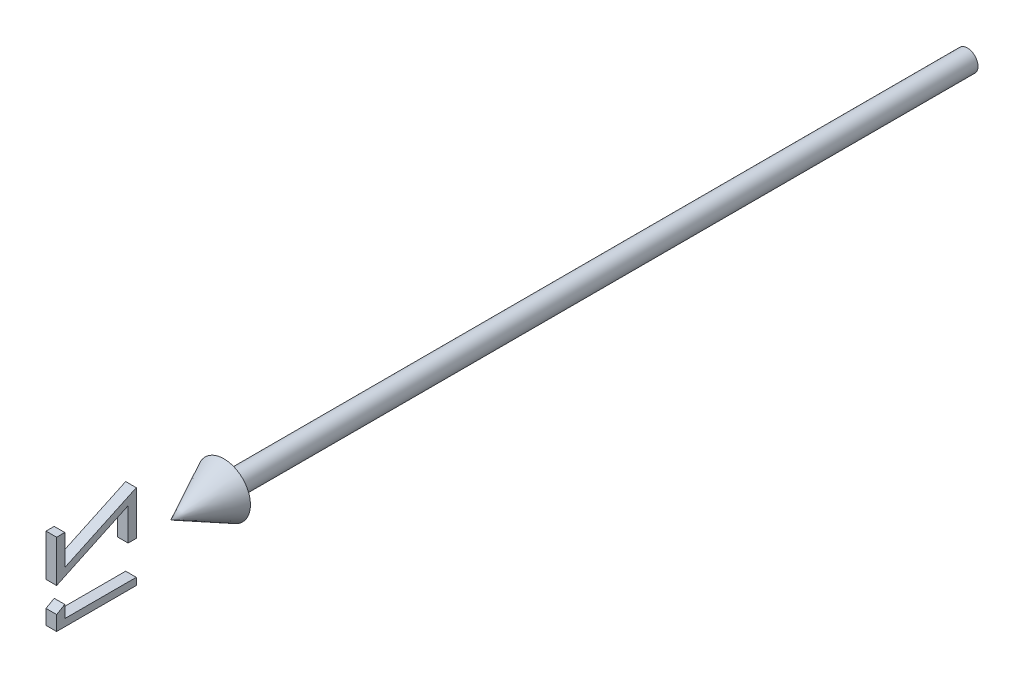
ISO-10303-21;
HEADER;
FILE_DESCRIPTION(('STEP AP214'),'2;1');
FILE_NAME('part.step','',(''),(''),'','','');
FILE_SCHEMA(('AUTOMOTIVE_DESIGN { 1 0 10303 214 1 1 1 1 }'));
ENDSEC;
DATA;
#1=APPLICATION_CONTEXT('core data for automotive mechanical design processes');
#2=APPLICATION_PROTOCOL_DEFINITION('international standard','automotive_design',2000,#1);
#3=PRODUCT_CONTEXT('',#1,'mechanical');
#4=PRODUCT('Part','Part','',(#3));
#5=PRODUCT_RELATED_PRODUCT_CATEGORY('part','',(#4));
#6=PRODUCT_DEFINITION_FORMATION('','',#4);
#7=PRODUCT_DEFINITION_CONTEXT('part definition',#1,'design');
#8=PRODUCT_DEFINITION('design','',#6,#7);
#9=PRODUCT_DEFINITION_SHAPE('','',#8);
#10=(LENGTH_UNIT() NAMED_UNIT(*) SI_UNIT(.MILLI.,.METRE.));
#11=(NAMED_UNIT(*) PLANE_ANGLE_UNIT() SI_UNIT($,.RADIAN.));
#12=(NAMED_UNIT(*) SI_UNIT($,.STERADIAN.) SOLID_ANGLE_UNIT());
#13=UNCERTAINTY_MEASURE_WITH_UNIT(LENGTH_MEASURE(1.E-05),#10,'distance_accuracy_value','');
#14=(GEOMETRIC_REPRESENTATION_CONTEXT(3) GLOBAL_UNCERTAINTY_ASSIGNED_CONTEXT((#13)) GLOBAL_UNIT_ASSIGNED_CONTEXT((#10,
#11,#12)) REPRESENTATION_CONTEXT('',''));
#15=CARTESIAN_POINT('',(0.,0.,0.));
#16=DIRECTION('',(0.,0.,1.));
#17=DIRECTION('',(1.,0.,0.));
#18=AXIS2_PLACEMENT_3D('',#15,#16,#17);
#19=CARTESIAN_POINT('',(1.00000000000009,-2.77218270945082,170.961538461538));
#20=DIRECTION('',(0.,-0.867930013859705,-0.49668651183769));
#21=DIRECTION('',(0.,0.49668651183769,-0.867930013859705));
#22=AXIS2_PLACEMENT_3D('',#19,#20,#21);
#23=PLANE('',#22);
#24=DIRECTION('',(-1.,0.,0.));
#25=VECTOR('',#24,1.);
#26=CARTESIAN_POINT('',(1.00000000000009,-2.77218270945082,170.961538461538));
#27=LINE('',#26,#25);
#28=CARTESIAN_POINT('',(1.00000000000009,-2.77218270945082,170.961538461538));
#29=VERTEX_POINT('',#28);
#30=CARTESIAN_POINT('',(-0.999999999999906,-2.77218270945082,170.961538461538));
#31=VERTEX_POINT('',#30);
#32=EDGE_CURVE('E116',#29,#31,#27,.T.);
#33=ORIENTED_EDGE('',*,*,#32,.T.);
#34=DIRECTION('',(0.,-0.49668651183769,0.867930013859705));
#35=VECTOR('',#34,1.);
#36=CARTESIAN_POINT('',(-0.999999999999906,-2.77218270945082,170.961538461538));
#37=LINE('',#36,#35);
#38=CARTESIAN_POINT('',(-0.999999999999895,-3.65259136329697,172.5));
#39=VERTEX_POINT('',#38);
#40=EDGE_CURVE('E110',#31,#39,#37,.T.);
#41=ORIENTED_EDGE('',*,*,#40,.T.);
#42=DIRECTION('',(-1.,0.,0.));
#43=VECTOR('',#42,1.);
#44=CARTESIAN_POINT('',(1.0000000000001,-3.65259136329697,172.5));
#45=LINE('',#44,#43);
#46=CARTESIAN_POINT('',(1.0000000000001,-3.65259136329697,172.5));
#47=VERTEX_POINT('',#46);
#48=EDGE_CURVE('E12',#47,#39,#45,.T.);
#49=ORIENTED_EDGE('',*,*,#48,.F.);
#50=DIRECTION('',(0.,-0.49668651183769,0.867930013859705));
#51=VECTOR('',#50,1.);
#52=CARTESIAN_POINT('',(1.00000000000009,-2.77218270945082,170.961538461538));
#53=LINE('',#52,#51);
#54=EDGE_CURVE('E128',#29,#47,#53,.T.);
#55=ORIENTED_EDGE('',*,*,#54,.F.);
#56=EDGE_LOOP('',(#33,#41,#49,#55));
#57=FACE_BOUND('',#56,.T.);
#58=ADVANCED_FACE('F46',(#57),#23,.F.);
#59=CARTESIAN_POINT('',(1.0000000000001,-3.65259136329697,172.5));
#60=DIRECTION('',(0.,0.,-1.));
#61=DIRECTION('',(-1.,0.,0.));
#62=AXIS2_PLACEMENT_3D('',#59,#60,#61);
#63=PLANE('',#62);
#64=ORIENTED_EDGE('',*,*,#48,.T.);
#65=DIRECTION('',(0.,-1.,0.));
#66=VECTOR('',#65,1.);
#67=CARTESIAN_POINT('',(-0.999999999999895,-3.65259136329697,172.5));
#68=LINE('',#67,#66);
#69=CARTESIAN_POINT('',(-0.999999999999895,-6.42602886329697,172.5));
#70=VERTEX_POINT('',#69);
#71=EDGE_CURVE('E100',#39,#70,#68,.T.);
#72=ORIENTED_EDGE('',*,*,#71,.T.);
#73=DIRECTION('',(-1.,0.,0.));
#74=VECTOR('',#73,1.);
#75=CARTESIAN_POINT('',(1.0000000000001,-6.42602886329697,172.5));
#76=LINE('',#75,#74);
#77=CARTESIAN_POINT('',(1.0000000000001,-6.42602886329697,172.5));
#78=VERTEX_POINT('',#77);
#79=EDGE_CURVE('E53',#78,#70,#76,.T.);
#80=ORIENTED_EDGE('',*,*,#79,.F.);
#81=DIRECTION('',(0.,-1.,0.));
#82=VECTOR('',#81,1.);
#83=CARTESIAN_POINT('',(1.0000000000001,-3.65259136329697,172.5));
#84=LINE('',#83,#82);
#85=EDGE_CURVE('E101',#47,#78,#84,.T.);
#86=ORIENTED_EDGE('',*,*,#85,.F.);
#87=EDGE_LOOP('',(#64,#72,#80,#86));
#88=FACE_BOUND('',#87,.T.);
#89=ADVANCED_FACE('F98',(#88),#63,.F.);
#90=CARTESIAN_POINT('',(1.0000000000001,-6.42602886329697,172.5));
#91=DIRECTION('',(0.,1.,0.));
#92=DIRECTION('',(0.,0.,1.));
#93=AXIS2_PLACEMENT_3D('',#90,#91,#92);
#94=PLANE('',#93);
#95=ORIENTED_EDGE('',*,*,#79,.T.);
#96=DIRECTION('',(0.,0.,-1.));
#97=VECTOR('',#96,1.);
#98=CARTESIAN_POINT('',(-0.999999999999895,-6.42602886329697,172.5));
#99=LINE('',#98,#97);
#100=CARTESIAN_POINT('',(-1.,-6.42602886329697,157.5));
#101=VERTEX_POINT('',#100);
#102=EDGE_CURVE('E114',#70,#101,#99,.T.);
#103=ORIENTED_EDGE('',*,*,#102,.T.);
#104=DIRECTION('',(-1.,0.,0.));
#105=VECTOR('',#104,1.);
#106=CARTESIAN_POINT('',(1.,-6.42602886329697,157.5));
#107=LINE('',#106,#105);
#108=CARTESIAN_POINT('',(1.,-6.42602886329697,157.5));
#109=VERTEX_POINT('',#108);
#110=EDGE_CURVE('E142',#109,#101,#107,.T.);
#111=ORIENTED_EDGE('',*,*,#110,.F.);
#112=DIRECTION('',(0.,0.,-1.));
#113=VECTOR('',#112,1.);
#114=CARTESIAN_POINT('',(1.0000000000001,-6.42602886329697,172.5));
#115=LINE('',#114,#113);
#116=EDGE_CURVE('E131',#78,#109,#115,.T.);
#117=ORIENTED_EDGE('',*,*,#116,.F.);
#118=EDGE_LOOP('',(#95,#103,#111,#117));
#119=FACE_BOUND('',#118,.T.);
#120=ADVANCED_FACE('F145',(#119),#94,.F.);
#121=CARTESIAN_POINT('',(1.,-6.42602886329697,157.5));
#122=DIRECTION('',(0.,0.,1.));
#123=DIRECTION('',(1.,0.,0.));
#124=AXIS2_PLACEMENT_3D('',#121,#122,#123);
#125=PLANE('',#124);
#126=ORIENTED_EDGE('',*,*,#110,.T.);
#127=DIRECTION('',(0.,1.,0.));
#128=VECTOR('',#127,1.);
#129=CARTESIAN_POINT('',(-1.,-6.42602886329697,157.5));
#130=LINE('',#129,#128);
#131=CARTESIAN_POINT('',(-1.,-5.07987501714312,157.5));
#132=VERTEX_POINT('',#131);
#133=EDGE_CURVE('E120',#101,#132,#130,.T.);
#134=ORIENTED_EDGE('',*,*,#133,.T.);
#135=DIRECTION('',(-1.,0.,0.));
#136=VECTOR('',#135,1.);
#137=CARTESIAN_POINT('',(1.,-5.07987501714312,157.5));
#138=LINE('',#137,#136);
#139=CARTESIAN_POINT('',(1.,-5.07987501714312,157.5));
#140=VERTEX_POINT('',#139);
#141=EDGE_CURVE('E140',#140,#132,#138,.T.);
#142=ORIENTED_EDGE('',*,*,#141,.F.);
#143=DIRECTION('',(0.,1.,0.));
#144=VECTOR('',#143,1.);
#145=CARTESIAN_POINT('',(1.,-6.42602886329697,157.5));
#146=LINE('',#145,#144);
#147=EDGE_CURVE('E133',#109,#140,#146,.T.);
#148=ORIENTED_EDGE('',*,*,#147,.F.);
#149=EDGE_LOOP('',(#126,#134,#142,#148));
#150=FACE_BOUND('',#149,.T.);
#151=ADVANCED_FACE('F151',(#150),#125,.F.);
#152=CARTESIAN_POINT('',(1.,-5.07987501714312,157.5));
#153=DIRECTION('',(0.,-1.,0.));
#154=DIRECTION('',(0.,0.,-1.));
#155=AXIS2_PLACEMENT_3D('',#152,#153,#154);
#156=PLANE('',#155);
#157=ORIENTED_EDGE('',*,*,#141,.T.);
#158=DIRECTION('',(0.,0.,1.));
#159=VECTOR('',#158,1.);
#160=CARTESIAN_POINT('',(-1.,-5.07987501714312,157.5));
#161=LINE('',#160,#159);
#162=CARTESIAN_POINT('',(-0.999999999999906,-5.07987501714312,170.961538461538));
#163=VERTEX_POINT('',#162);
#164=EDGE_CURVE('E123',#132,#163,#161,.T.);
#165=ORIENTED_EDGE('',*,*,#164,.T.);
#166=DIRECTION('',(-1.,0.,0.));
#167=VECTOR('',#166,1.);
#168=CARTESIAN_POINT('',(1.00000000000009,-5.07987501714312,170.961538461538));
#169=LINE('',#168,#167);
#170=CARTESIAN_POINT('',(1.00000000000009,-5.07987501714312,170.961538461538));
#171=VERTEX_POINT('',#170);
#172=EDGE_CURVE('E138',#171,#163,#169,.T.);
#173=ORIENTED_EDGE('',*,*,#172,.F.);
#174=DIRECTION('',(0.,0.,1.));
#175=VECTOR('',#174,1.);
#176=CARTESIAN_POINT('',(1.,-5.07987501714312,157.5));
#177=LINE('',#176,#175);
#178=EDGE_CURVE('E65',#140,#171,#177,.T.);
#179=ORIENTED_EDGE('',*,*,#178,.F.);
#180=EDGE_LOOP('',(#157,#165,#173,#179));
#181=FACE_BOUND('',#180,.T.);
#182=ADVANCED_FACE('F154',(#181),#156,.F.);
#183=CARTESIAN_POINT('',(1.00000000000009,-5.07987501714312,170.961538461538));
#184=DIRECTION('',(0.,0.,1.));
#185=DIRECTION('',(1.,0.,0.));
#186=AXIS2_PLACEMENT_3D('',#183,#184,#185);
#187=PLANE('',#186);
#188=ORIENTED_EDGE('',*,*,#172,.T.);
#189=DIRECTION('',(0.,1.,0.));
#190=VECTOR('',#189,1.);
#191=CARTESIAN_POINT('',(-0.999999999999906,-5.07987501714312,170.961538461538));
#192=LINE('',#191,#190);
#193=EDGE_CURVE('E126',#163,#31,#192,.T.);
#194=ORIENTED_EDGE('',*,*,#193,.T.);
#195=ORIENTED_EDGE('',*,*,#32,.F.);
#196=DIRECTION('',(0.,1.,0.));
#197=VECTOR('',#196,1.);
#198=CARTESIAN_POINT('',(1.00000000000009,-5.07987501714312,170.961538461538));
#199=LINE('',#198,#197);
#200=EDGE_CURVE('E60',#171,#29,#199,.T.);
#201=ORIENTED_EDGE('',*,*,#200,.F.);
#202=EDGE_LOOP('',(#188,#194,#195,#201));
#203=FACE_BOUND('',#202,.T.);
#204=ADVANCED_FACE('F156',(#203),#187,.F.);
#205=CARTESIAN_POINT('',(0.9999999999989,0.,0.));
#206=DIRECTION('',(1.,0.,0.));
#207=DIRECTION('',(0.,0.,-1.));
#208=AXIS2_PLACEMENT_3D('',#205,#206,#207);
#209=PLANE('',#208);
#210=ORIENTED_EDGE('',*,*,#54,.T.);
#211=ORIENTED_EDGE('',*,*,#85,.T.);
#212=ORIENTED_EDGE('',*,*,#116,.T.);
#213=ORIENTED_EDGE('',*,*,#147,.T.);
#214=ORIENTED_EDGE('',*,*,#178,.T.);
#215=ORIENTED_EDGE('',*,*,#200,.T.);
#216=EDGE_LOOP('',(#210,#211,#212,#213,#214,#215));
#217=FACE_BOUND('',#216,.T.);
#218=ADVANCED_FACE('F148',(#217),#209,.T.);
#219=CARTESIAN_POINT('',(-1.0000000000011,0.,0.));
#220=DIRECTION('',(1.,0.,0.));
#221=DIRECTION('',(0.,0.,-1.));
#222=AXIS2_PLACEMENT_3D('',#219,#220,#221);
#223=PLANE('',#222);
#224=ORIENTED_EDGE('',*,*,#40,.F.);
#225=ORIENTED_EDGE('',*,*,#193,.F.);
#226=ORIENTED_EDGE('',*,*,#164,.F.);
#227=ORIENTED_EDGE('',*,*,#133,.F.);
#228=ORIENTED_EDGE('',*,*,#102,.F.);
#229=ORIENTED_EDGE('',*,*,#71,.F.);
#230=EDGE_LOOP('',(#224,#225,#226,#227,#228,#229));
#231=FACE_BOUND('',#230,.T.);
#232=ADVANCED_FACE('F108',(#231),#223,.F.);
#233=CLOSED_SHELL('',(#58,#89,#120,#151,#182,#204,#218,#232));
#234=MANIFOLD_SOLID_BREP('B2',#233);
#235=CARTESIAN_POINT('',(1.00000000000009,3.24344229054918,170.961538461538));
#236=DIRECTION('',(0.,0.,1.));
#237=DIRECTION('',(1.,0.,0.));
#238=AXIS2_PLACEMENT_3D('',#235,#236,#237);
#239=PLANE('',#238);
#240=DIRECTION('',(-1.,0.,0.));
#241=VECTOR('',#240,1.);
#242=CARTESIAN_POINT('',(1.00000000000009,3.24344229054918,170.961538461538));
#243=LINE('',#242,#241);
#244=CARTESIAN_POINT('',(1.00000000000009,3.24344229054918,170.961538461538));
#245=VERTEX_POINT('',#244);
#246=CARTESIAN_POINT('',(-0.999999999999906,3.24344229054918,170.961538461538));
#247=VERTEX_POINT('',#246);
#248=EDGE_CURVE('E313',#245,#247,#243,.T.);
#249=ORIENTED_EDGE('',*,*,#248,.T.);
#250=DIRECTION('',(0.,1.,0.));
#251=VECTOR('',#250,1.);
#252=CARTESIAN_POINT('',(-0.999999999999906,3.24344229054918,170.961538461538));
#253=LINE('',#252,#251);
#254=CARTESIAN_POINT('',(-0.999999999999906,8.95858652131841,170.961538461538));
#255=VERTEX_POINT('',#254);
#256=EDGE_CURVE('E307',#247,#255,#253,.T.);
#257=ORIENTED_EDGE('',*,*,#256,.T.);
#258=DIRECTION('',(-1.,0.,0.));
#259=VECTOR('',#258,1.);
#260=CARTESIAN_POINT('',(1.00000000000009,8.95858652131841,170.961538461538));
#261=LINE('',#260,#259);
#262=CARTESIAN_POINT('',(1.00000000000009,8.95858652131841,170.961538461538));
#263=VERTEX_POINT('',#262);
#264=EDGE_CURVE('E44',#263,#255,#261,.T.);
#265=ORIENTED_EDGE('',*,*,#264,.F.);
#266=DIRECTION('',(0.,1.,0.));
#267=VECTOR('',#266,1.);
#268=CARTESIAN_POINT('',(1.00000000000009,3.24344229054918,170.961538461538));
#269=LINE('',#268,#267);
#270=EDGE_CURVE('E331',#245,#263,#269,.T.);
#271=ORIENTED_EDGE('',*,*,#270,.F.);
#272=EDGE_LOOP('',(#249,#257,#265,#271));
#273=FACE_BOUND('',#272,.T.);
#274=ADVANCED_FACE('F231',(#273),#239,.F.);
#275=CARTESIAN_POINT('',(1.00000000000009,8.95858652131841,170.961538461538));
#276=DIRECTION('',(0.,-1.,0.));
#277=DIRECTION('',(0.,0.,-1.));
#278=AXIS2_PLACEMENT_3D('',#275,#276,#277);
#279=PLANE('',#278);
#280=ORIENTED_EDGE('',*,*,#264,.T.);
#281=DIRECTION('',(0.,0.,1.));
#282=VECTOR('',#281,1.);
#283=CARTESIAN_POINT('',(-0.999999999999906,8.95858652131841,170.961538461538));
#284=LINE('',#283,#282);
#285=CARTESIAN_POINT('',(-0.999999999999895,8.95858652131841,172.5));
#286=VERTEX_POINT('',#285);
#287=EDGE_CURVE('E297',#255,#286,#284,.T.);
#288=ORIENTED_EDGE('',*,*,#287,.T.);
#289=DIRECTION('',(-1.,0.,0.));
#290=VECTOR('',#289,1.);
#291=CARTESIAN_POINT('',(1.0000000000001,8.95858652131841,172.5));
#292=LINE('',#291,#290);
#293=CARTESIAN_POINT('',(1.0000000000001,8.95858652131841,172.5));
#294=VERTEX_POINT('',#293);
#295=EDGE_CURVE('E238',#294,#286,#292,.T.);
#296=ORIENTED_EDGE('',*,*,#295,.F.);
#297=DIRECTION('',(0.,0.,1.));
#298=VECTOR('',#297,1.);
#299=CARTESIAN_POINT('',(1.00000000000009,8.95858652131841,170.961538461538));
#300=LINE('',#299,#298);
#301=EDGE_CURVE('E298',#263,#294,#300,.T.);
#302=ORIENTED_EDGE('',*,*,#301,.F.);
#303=EDGE_LOOP('',(#280,#288,#296,#302));
#304=FACE_BOUND('',#303,.T.);
#305=ADVANCED_FACE('F295',(#304),#279,.F.);
#306=CARTESIAN_POINT('',(1.0000000000001,8.95858652131841,172.5));
#307=DIRECTION('',(0.,0.,-1.));
#308=DIRECTION('',(-1.,0.,0.));
#309=AXIS2_PLACEMENT_3D('',#306,#307,#308);
#310=PLANE('',#309);
#311=ORIENTED_EDGE('',*,*,#295,.T.);
#312=DIRECTION('',(0.,-1.,0.));
#313=VECTOR('',#312,1.);
#314=CARTESIAN_POINT('',(-0.999999999999895,8.95858652131841,172.5));
#315=LINE('',#314,#313);
#316=CARTESIAN_POINT('',(-0.999999999999895,1.07397113670303,172.5));
#317=VERTEX_POINT('',#316);
#318=EDGE_CURVE('E311',#286,#317,#315,.T.);
#319=ORIENTED_EDGE('',*,*,#318,.T.);
#320=DIRECTION('',(-1.,0.,0.));
#321=VECTOR('',#320,1.);
#322=CARTESIAN_POINT('',(1.0000000000001,1.07397113670303,172.5));
#323=LINE('',#322,#321);
#324=CARTESIAN_POINT('',(1.0000000000001,1.07397113670303,172.5));
#325=VERTEX_POINT('',#324);
#326=EDGE_CURVE('E353',#325,#317,#323,.T.);
#327=ORIENTED_EDGE('',*,*,#326,.F.);
#328=DIRECTION('',(0.,-1.,0.));
#329=VECTOR('',#328,1.);
#330=CARTESIAN_POINT('',(1.0000000000001,8.95858652131841,172.5));
#331=LINE('',#330,#329);
#332=EDGE_CURVE('E334',#294,#325,#331,.T.);
#333=ORIENTED_EDGE('',*,*,#332,.F.);
#334=EDGE_LOOP('',(#311,#319,#327,#333));
#335=FACE_BOUND('',#334,.T.);
#336=ADVANCED_FACE('F356',(#335),#310,.F.);
#337=CARTESIAN_POINT('',(1.0000000000001,1.07397113670303,172.5));
#338=DIRECTION('',(0.,0.905924666699453,0.42343889555104));
#339=DIRECTION('',(0.,-0.42343889555104,0.905924666699454));
#340=AXIS2_PLACEMENT_3D('',#337,#338,#339);
#341=PLANE('',#340);
#342=ORIENTED_EDGE('',*,*,#326,.T.);
#343=DIRECTION('',(0.,0.42343889555104,-0.905924666699453));
#344=VECTOR('',#343,1.);
#345=CARTESIAN_POINT('',(-0.999999999999895,1.07397113670303,172.5));
#346=LINE('',#345,#344);
#347=CARTESIAN_POINT('',(-0.999999999999989,7.36603844439534,159.038461538462));
#348=VERTEX_POINT('',#347);
#349=EDGE_CURVE('E317',#317,#348,#346,.T.);
#350=ORIENTED_EDGE('',*,*,#349,.T.);
#351=DIRECTION('',(-1.,0.,0.));
#352=VECTOR('',#351,1.);
#353=CARTESIAN_POINT('',(1.00000000000001,7.36603844439534,159.038461538462));
#354=LINE('',#353,#352);
#355=CARTESIAN_POINT('',(1.00000000000001,7.36603844439534,159.038461538462));
#356=VERTEX_POINT('',#355);
#357=EDGE_CURVE('E351',#356,#348,#354,.T.);
#358=ORIENTED_EDGE('',*,*,#357,.F.);
#359=DIRECTION('',(0.,0.42343889555104,-0.905924666699453));
#360=VECTOR('',#359,1.);
#361=CARTESIAN_POINT('',(1.0000000000001,1.07397113670303,172.5));
#362=LINE('',#361,#360);
#363=EDGE_CURVE('E336',#325,#356,#362,.T.);
#364=ORIENTED_EDGE('',*,*,#363,.F.);
#365=EDGE_LOOP('',(#342,#350,#358,#364));
#366=FACE_BOUND('',#365,.T.);
#367=ADVANCED_FACE('F364',(#366),#341,.F.);
#368=CARTESIAN_POINT('',(1.00000000000001,7.36603844439534,159.038461538462));
#369=DIRECTION('',(0.,0.,-1.));
#370=DIRECTION('',(-1.,0.,0.));
#371=AXIS2_PLACEMENT_3D('',#368,#369,#370);
#372=PLANE('',#371);
#373=ORIENTED_EDGE('',*,*,#357,.T.);
#374=DIRECTION('',(0.,-1.,0.));
#375=VECTOR('',#374,1.);
#376=CARTESIAN_POINT('',(-0.999999999999989,7.36603844439534,159.038461538462));
#377=LINE('',#376,#375);
#378=CARTESIAN_POINT('',(-0.999999999999989,1.26627882901072,159.038461538462));
#379=VERTEX_POINT('',#378);
#380=EDGE_CURVE('E320',#348,#379,#377,.T.);
#381=ORIENTED_EDGE('',*,*,#380,.T.);
#382=DIRECTION('',(-1.,0.,0.));
#383=VECTOR('',#382,1.);
#384=CARTESIAN_POINT('',(1.00000000000001,1.26627882901072,159.038461538462));
#385=LINE('',#384,#383);
#386=CARTESIAN_POINT('',(1.00000000000001,1.26627882901072,159.038461538462));
#387=VERTEX_POINT('',#386);
#388=EDGE_CURVE('E349',#387,#379,#385,.T.);
#389=ORIENTED_EDGE('',*,*,#388,.F.);
#390=DIRECTION('',(0.,-1.,0.));
#391=VECTOR('',#390,1.);
#392=CARTESIAN_POINT('',(1.00000000000001,7.36603844439534,159.038461538462));
#393=LINE('',#392,#391);
#394=EDGE_CURVE('E338',#356,#387,#393,.T.);
#395=ORIENTED_EDGE('',*,*,#394,.F.);
#396=EDGE_LOOP('',(#373,#381,#389,#395));
#397=FACE_BOUND('',#396,.T.);
#398=ADVANCED_FACE('F367',(#397),#372,.F.);
#399=CARTESIAN_POINT('',(1.00000000000001,1.26627882901072,159.038461538462));
#400=DIRECTION('',(0.,1.,0.));
#401=DIRECTION('',(0.,0.,1.));
#402=AXIS2_PLACEMENT_3D('',#399,#400,#401);
#403=PLANE('',#402);
#404=ORIENTED_EDGE('',*,*,#388,.T.);
#405=DIRECTION('',(0.,0.,-1.));
#406=VECTOR('',#405,1.);
#407=CARTESIAN_POINT('',(-0.999999999999989,1.26627882901072,159.038461538462));
#408=LINE('',#407,#406);
#409=CARTESIAN_POINT('',(-1.,1.26627882901072,157.5));
#410=VERTEX_POINT('',#409);
#411=EDGE_CURVE('E323',#379,#410,#408,.T.);
#412=ORIENTED_EDGE('',*,*,#411,.T.);
#413=DIRECTION('',(-1.,0.,0.));
#414=VECTOR('',#413,1.);
#415=CARTESIAN_POINT('',(1.,1.26627882901072,157.5));
#416=LINE('',#415,#414);
#417=CARTESIAN_POINT('',(1.,1.26627882901072,157.5));
#418=VERTEX_POINT('',#417);
#419=EDGE_CURVE('E347',#418,#410,#416,.T.);
#420=ORIENTED_EDGE('',*,*,#419,.F.);
#421=DIRECTION('',(0.,0.,-1.));
#422=VECTOR('',#421,1.);
#423=CARTESIAN_POINT('',(1.00000000000001,1.26627882901072,159.038461538462));
#424=LINE('',#423,#422);
#425=EDGE_CURVE('E340',#387,#418,#424,.T.);
#426=ORIENTED_EDGE('',*,*,#425,.F.);
#427=EDGE_LOOP('',(#404,#412,#420,#426));
#428=FACE_BOUND('',#427,.T.);
#429=ADVANCED_FACE('F372',(#428),#403,.F.);
#430=CARTESIAN_POINT('',(1.,1.26627882901072,157.5));
#431=DIRECTION('',(0.,0.,1.));
#432=DIRECTION('',(1.,0.,0.));
#433=AXIS2_PLACEMENT_3D('',#430,#431,#432);
#434=PLANE('',#433);
#435=ORIENTED_EDGE('',*,*,#419,.T.);
#436=DIRECTION('',(0.,1.,0.));
#437=VECTOR('',#436,1.);
#438=CARTESIAN_POINT('',(-1.,1.26627882901072,157.5));
#439=LINE('',#438,#437);
#440=CARTESIAN_POINT('',(-1.,9.53550959824149,157.5));
#441=VERTEX_POINT('',#440);
#442=EDGE_CURVE('E326',#410,#441,#439,.T.);
#443=ORIENTED_EDGE('',*,*,#442,.T.);
#444=DIRECTION('',(-1.,0.,0.));
#445=VECTOR('',#444,1.);
#446=CARTESIAN_POINT('',(1.,9.53550959824149,157.5));
#447=LINE('',#446,#445);
#448=CARTESIAN_POINT('',(1.,9.53550959824149,157.5));
#449=VERTEX_POINT('',#448);
#450=EDGE_CURVE('E345',#449,#441,#447,.T.);
#451=ORIENTED_EDGE('',*,*,#450,.F.);
#452=DIRECTION('',(0.,1.,0.));
#453=VECTOR('',#452,1.);
#454=CARTESIAN_POINT('',(1.,1.26627882901072,157.5));
#455=LINE('',#454,#453);
#456=EDGE_CURVE('E250',#418,#449,#455,.T.);
#457=ORIENTED_EDGE('',*,*,#456,.F.);
#458=EDGE_LOOP('',(#435,#443,#451,#457));
#459=FACE_BOUND('',#458,.T.);
#460=ADVANCED_FACE('F375',(#459),#434,.F.);
#461=CARTESIAN_POINT('',(1.,9.53550959824149,157.5));
#462=DIRECTION('',(0.,-0.905924666699454,-0.423438895551039));
#463=DIRECTION('',(0.,0.423438895551039,-0.905924666699454));
#464=AXIS2_PLACEMENT_3D('',#461,#462,#463);
#465=PLANE('',#464);
#466=ORIENTED_EDGE('',*,*,#450,.T.);
#467=DIRECTION('',(0.,-0.423438895551039,0.905924666699454));
#468=VECTOR('',#467,1.);
#469=CARTESIAN_POINT('',(-1.,9.53550959824149,157.5));
#470=LINE('',#469,#468);
#471=EDGE_CURVE('E329',#441,#247,#470,.T.);
#472=ORIENTED_EDGE('',*,*,#471,.T.);
#473=ORIENTED_EDGE('',*,*,#248,.F.);
#474=DIRECTION('',(0.,-0.423438895551039,0.905924666699454));
#475=VECTOR('',#474,1.);
#476=CARTESIAN_POINT('',(1.,9.53550959824149,157.5));
#477=LINE('',#476,#475);
#478=EDGE_CURVE('E245',#449,#245,#477,.T.);
#479=ORIENTED_EDGE('',*,*,#478,.F.);
#480=EDGE_LOOP('',(#466,#472,#473,#479));
#481=FACE_BOUND('',#480,.T.);
#482=ADVANCED_FACE('F377',(#481),#465,.F.);
#483=CARTESIAN_POINT('',(0.9999999999989,0.,0.));
#484=DIRECTION('',(1.,0.,0.));
#485=DIRECTION('',(0.,0.,-1.));
#486=AXIS2_PLACEMENT_3D('',#483,#484,#485);
#487=PLANE('',#486);
#488=ORIENTED_EDGE('',*,*,#270,.T.);
#489=ORIENTED_EDGE('',*,*,#301,.T.);
#490=ORIENTED_EDGE('',*,*,#332,.T.);
#491=ORIENTED_EDGE('',*,*,#363,.T.);
#492=ORIENTED_EDGE('',*,*,#394,.T.);
#493=ORIENTED_EDGE('',*,*,#425,.T.);
#494=ORIENTED_EDGE('',*,*,#456,.T.);
#495=ORIENTED_EDGE('',*,*,#478,.T.);
#496=EDGE_LOOP('',(#488,#489,#490,#491,#492,#493,#494,#495));
#497=FACE_BOUND('',#496,.T.);
#498=ADVANCED_FACE('F359',(#497),#487,.T.);
#499=CARTESIAN_POINT('',(-1.0000000000011,0.,0.));
#500=DIRECTION('',(1.,0.,0.));
#501=DIRECTION('',(0.,0.,-1.));
#502=AXIS2_PLACEMENT_3D('',#499,#500,#501);
#503=PLANE('',#502);
#504=ORIENTED_EDGE('',*,*,#256,.F.);
#505=ORIENTED_EDGE('',*,*,#471,.F.);
#506=ORIENTED_EDGE('',*,*,#442,.F.);
#507=ORIENTED_EDGE('',*,*,#411,.F.);
#508=ORIENTED_EDGE('',*,*,#380,.F.);
#509=ORIENTED_EDGE('',*,*,#349,.F.);
#510=ORIENTED_EDGE('',*,*,#318,.F.);
#511=ORIENTED_EDGE('',*,*,#287,.F.);
#512=EDGE_LOOP('',(#504,#505,#506,#507,#508,#509,#510,#511));
#513=FACE_BOUND('',#512,.T.);
#514=ADVANCED_FACE('F305',(#513),#503,.F.);
#515=CLOSED_SHELL('',(#274,#305,#336,#367,#398,#429,#460,#482,#498,#514));
#516=MANIFOLD_SOLID_BREP('B6',#515);
#517=CARTESIAN_POINT('',(2.,0.,0.));
#518=DIRECTION('',(0.,0.,1.));
#519=DIRECTION('',(1.,0.,0.));
#520=AXIS2_PLACEMENT_3D('',#517,#518,#519);
#521=PLANE('',#520);
#522=CARTESIAN_POINT('',(0.,0.,0.));
#523=DIRECTION('',(0.,0.,-1.));
#524=DIRECTION('',(-1.,0.,0.));
#525=AXIS2_PLACEMENT_3D('',#522,#523,#524);
#526=CIRCLE('',#525,2.);
#527=CARTESIAN_POINT('',(-2.,0.,0.));
#528=VERTEX_POINT('',#527);
#529=EDGE_CURVE('E229',#528,#528,#526,.T.);
#530=ORIENTED_EDGE('',*,*,#529,.T.);
#531=EDGE_LOOP('',(#530));
#532=FACE_BOUND('',#531,.T.);
#533=ADVANCED_FACE('F459',(#532),#521,.F.);
#534=CARTESIAN_POINT('',(0.,0.,-41.9499520246458));
#535=DIRECTION('',(0.,0.,-1.));
#536=DIRECTION('',(-1.,0.,0.));
#537=AXIS2_PLACEMENT_3D('',#534,#535,#536);
#538=CYLINDRICAL_SURFACE('',#537,2.);
#539=ORIENTED_EDGE('',*,*,#529,.F.);
#540=EDGE_LOOP('',(#539));
#541=FACE_BOUND('',#540,.T.);
#542=CARTESIAN_POINT('',(0.,0.,140.));
#543=DIRECTION('',(0.,0.,-1.));
#544=DIRECTION('',(-1.,0.,0.));
#545=AXIS2_PLACEMENT_3D('',#542,#543,#544);
#546=CIRCLE('',#545,2.);
#547=CARTESIAN_POINT('',(-2.,0.,140.));
#548=VERTEX_POINT('',#547);
#549=EDGE_CURVE('E465',#548,#548,#546,.T.);
#550=ORIENTED_EDGE('',*,*,#549,.T.);
#551=EDGE_LOOP('',(#550));
#552=FACE_BOUND('',#551,.T.);
#553=ADVANCED_FACE('F476',(#541,#552),#538,.T.);
#554=CARTESIAN_POINT('',(5.00000000000002,0.,140.));
#555=DIRECTION('',(0.,0.,1.));
#556=DIRECTION('',(1.,0.,0.));
#557=AXIS2_PLACEMENT_3D('',#554,#555,#556);
#558=PLANE('',#557);
#559=ORIENTED_EDGE('',*,*,#549,.F.);
#560=EDGE_LOOP('',(#559));
#561=FACE_BOUND('',#560,.T.);
#562=CARTESIAN_POINT('',(0.,0.,140.));
#563=DIRECTION('',(0.,0.,-1.));
#564=DIRECTION('',(-1.,0.,0.));
#565=AXIS2_PLACEMENT_3D('',#562,#563,#564);
#566=CIRCLE('',#565,5.00000000000002);
#567=CARTESIAN_POINT('',(-5.00000000000002,0.,140.));
#568=VERTEX_POINT('',#567);
#569=EDGE_CURVE('E490',#568,#568,#566,.T.);
#570=ORIENTED_EDGE('',*,*,#569,.T.);
#571=EDGE_LOOP('',(#570));
#572=FACE_BOUND('',#571,.T.);
#573=ADVANCED_FACE('F470',(#561,#572),#558,.F.);
#574=CARTESIAN_POINT('',(0.,0.,150.));
#575=DIRECTION('',(0.,0.,-1.));
#576=DIRECTION('',(-1.,0.,0.));
#577=AXIS2_PLACEMENT_3D('',#574,#575,#576);
#578=CONICAL_SURFACE('',#577,0.,0.463647609000806);
#579=ORIENTED_EDGE('',*,*,#569,.F.);
#580=EDGE_LOOP('',(#579));
#581=FACE_BOUND('',#580,.T.);
#582=CARTESIAN_POINT('',(0.,0.,150.));
#583=VERTEX_POINT('',#582);
#584=VERTEX_LOOP('',#583);
#585=FACE_BOUND('',#584,.T.);
#586=ADVANCED_FACE('F468',(#581,#585),#578,.T.);
#587=CLOSED_SHELL('',(#533,#553,#573,#586));
#588=MANIFOLD_SOLID_BREP('B38',#587);
#589=ADVANCED_BREP_SHAPE_REPRESENTATION('',(#18,#234,#516,#588),#14);
#590=SHAPE_DEFINITION_REPRESENTATION(#9,#589);
ENDSEC;
END-ISO-10303-21;
